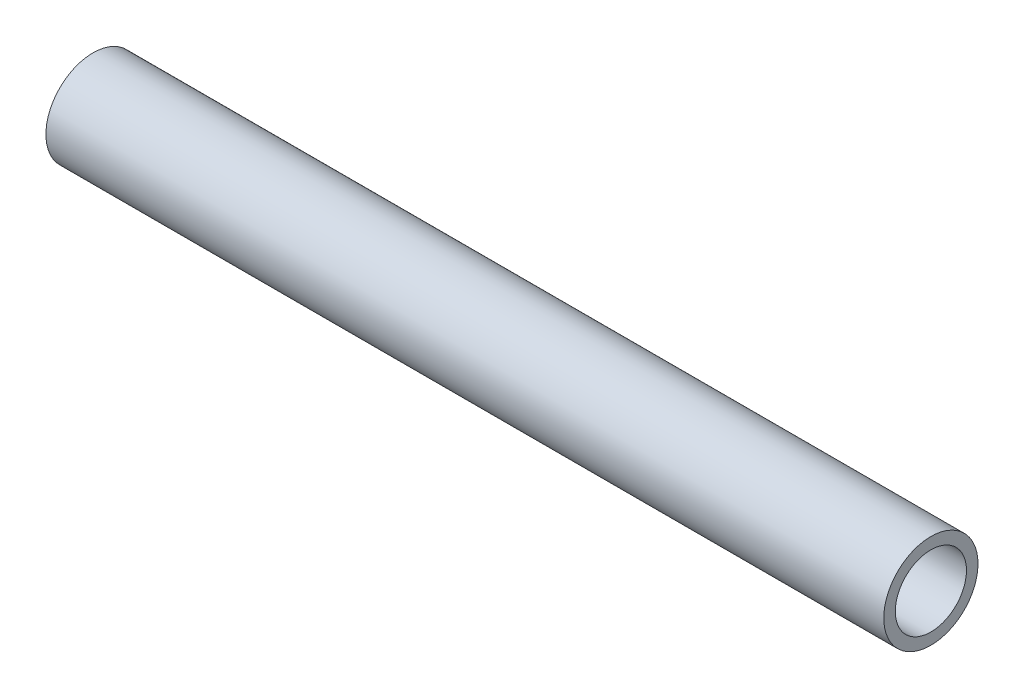
ISO-10303-21;
HEADER;
FILE_DESCRIPTION(('STEP AP214'),'2;1');
FILE_NAME('part.step','',(''),(''),'','','');
FILE_SCHEMA(('AUTOMOTIVE_DESIGN { 1 0 10303 214 1 1 1 1 }'));
ENDSEC;
DATA;
#1=APPLICATION_CONTEXT('core data for automotive mechanical design processes');
#2=APPLICATION_PROTOCOL_DEFINITION('international standard','automotive_design',2000,#1);
#3=PRODUCT_CONTEXT('',#1,'mechanical');
#4=PRODUCT('Part','Part','',(#3));
#5=PRODUCT_RELATED_PRODUCT_CATEGORY('part','',(#4));
#6=PRODUCT_DEFINITION_FORMATION('','',#4);
#7=PRODUCT_DEFINITION_CONTEXT('part definition',#1,'design');
#8=PRODUCT_DEFINITION('design','',#6,#7);
#9=PRODUCT_DEFINITION_SHAPE('','',#8);
#10=(LENGTH_UNIT() NAMED_UNIT(*) SI_UNIT(.MILLI.,.METRE.));
#11=(NAMED_UNIT(*) PLANE_ANGLE_UNIT() SI_UNIT($,.RADIAN.));
#12=(NAMED_UNIT(*) SI_UNIT($,.STERADIAN.) SOLID_ANGLE_UNIT());
#13=UNCERTAINTY_MEASURE_WITH_UNIT(LENGTH_MEASURE(1.E-05),#10,'distance_accuracy_value','');
#14=(GEOMETRIC_REPRESENTATION_CONTEXT(3) GLOBAL_UNCERTAINTY_ASSIGNED_CONTEXT((#13)) GLOBAL_UNIT_ASSIGNED_CONTEXT((#10,
#11,#12)) REPRESENTATION_CONTEXT('',''));
#15=CARTESIAN_POINT('',(0.,0.,0.));
#16=DIRECTION('',(0.,0.,1.));
#17=DIRECTION('',(1.,0.,0.));
#18=AXIS2_PLACEMENT_3D('',#15,#16,#17);
#19=CARTESIAN_POINT('',(254.,0.,0.));
#20=DIRECTION('',(1.,0.,0.));
#21=DIRECTION('',(0.,0.,-1.));
#22=AXIS2_PLACEMENT_3D('',#19,#20,#21);
#23=PLANE('',#22);
#24=CARTESIAN_POINT('',(254.,0.,0.));
#25=DIRECTION('',(1.,0.,0.));
#26=DIRECTION('',(0.,0.,-1.));
#27=AXIS2_PLACEMENT_3D('',#24,#25,#26);
#28=CIRCLE('',#27,28.575);
#29=CARTESIAN_POINT('',(254.,0.,-28.575));
#30=VERTEX_POINT('',#29);
#31=EDGE_CURVE('E10',#30,#30,#28,.T.);
#32=ORIENTED_EDGE('',*,*,#31,.T.);
#33=EDGE_LOOP('',(#32));
#34=FACE_BOUND('',#33,.T.);
#35=CARTESIAN_POINT('',(254.,0.,0.));
#36=DIRECTION('',(1.,0.,0.));
#37=DIRECTION('',(0.,0.,-1.));
#38=AXIS2_PLACEMENT_3D('',#35,#36,#37);
#39=CIRCLE('',#38,21.59);
#40=CARTESIAN_POINT('',(254.,0.,-21.59));
#41=VERTEX_POINT('',#40);
#42=EDGE_CURVE('E54',#41,#41,#39,.T.);
#43=ORIENTED_EDGE('',*,*,#42,.F.);
#44=EDGE_LOOP('',(#43));
#45=FACE_BOUND('',#44,.T.);
#46=ADVANCED_FACE('F41',(#34,#45),#23,.T.);
#47=CARTESIAN_POINT('',(-254.,0.,0.));
#48=DIRECTION('',(1.,0.,0.));
#49=DIRECTION('',(0.,0.,-1.));
#50=AXIS2_PLACEMENT_3D('',#47,#48,#49);
#51=PLANE('',#50);
#52=CARTESIAN_POINT('',(-254.,0.,0.));
#53=DIRECTION('',(1.,0.,0.));
#54=DIRECTION('',(0.,0.,-1.));
#55=AXIS2_PLACEMENT_3D('',#52,#53,#54);
#56=CIRCLE('',#55,28.575);
#57=CARTESIAN_POINT('',(-254.,0.,-28.575));
#58=VERTEX_POINT('',#57);
#59=EDGE_CURVE('E45',#58,#58,#56,.T.);
#60=ORIENTED_EDGE('',*,*,#59,.F.);
#61=EDGE_LOOP('',(#60));
#62=FACE_BOUND('',#61,.T.);
#63=CARTESIAN_POINT('',(-254.,0.,0.));
#64=DIRECTION('',(1.,0.,0.));
#65=DIRECTION('',(0.,0.,-1.));
#66=AXIS2_PLACEMENT_3D('',#63,#64,#65);
#67=CIRCLE('',#66,21.59);
#68=CARTESIAN_POINT('',(-254.,0.,-21.59));
#69=VERTEX_POINT('',#68);
#70=EDGE_CURVE('E56',#69,#69,#67,.T.);
#71=ORIENTED_EDGE('',*,*,#70,.T.);
#72=EDGE_LOOP('',(#71));
#73=FACE_BOUND('',#72,.T.);
#74=ADVANCED_FACE('F68',(#62,#73),#51,.F.);
#75=CARTESIAN_POINT('',(254.,0.,0.));
#76=DIRECTION('',(-1.,0.,0.));
#77=DIRECTION('',(0.,0.,1.));
#78=AXIS2_PLACEMENT_3D('',#75,#76,#77);
#79=CYLINDRICAL_SURFACE('',#78,28.575);
#80=ORIENTED_EDGE('',*,*,#31,.F.);
#81=EDGE_LOOP('',(#80));
#82=FACE_BOUND('',#81,.T.);
#83=ORIENTED_EDGE('',*,*,#59,.T.);
#84=EDGE_LOOP('',(#83));
#85=FACE_BOUND('',#84,.T.);
#86=ADVANCED_FACE('F43',(#82,#85),#79,.T.);
#87=CARTESIAN_POINT('',(254.,0.,0.));
#88=DIRECTION('',(-1.,0.,0.));
#89=DIRECTION('',(0.,0.,1.));
#90=AXIS2_PLACEMENT_3D('',#87,#88,#89);
#91=CYLINDRICAL_SURFACE('',#90,21.59);
#92=ORIENTED_EDGE('',*,*,#42,.T.);
#93=EDGE_LOOP('',(#92));
#94=FACE_BOUND('',#93,.T.);
#95=ORIENTED_EDGE('',*,*,#70,.F.);
#96=EDGE_LOOP('',(#95));
#97=FACE_BOUND('',#96,.T.);
#98=ADVANCED_FACE('F64',(#94,#97),#91,.F.);
#99=CLOSED_SHELL('',(#46,#74,#86,#98));
#100=MANIFOLD_SOLID_BREP('B2',#99);
#101=ADVANCED_BREP_SHAPE_REPRESENTATION('',(#18,#100),#14);
#102=SHAPE_DEFINITION_REPRESENTATION(#9,#101);
ENDSEC;
END-ISO-10303-21;
